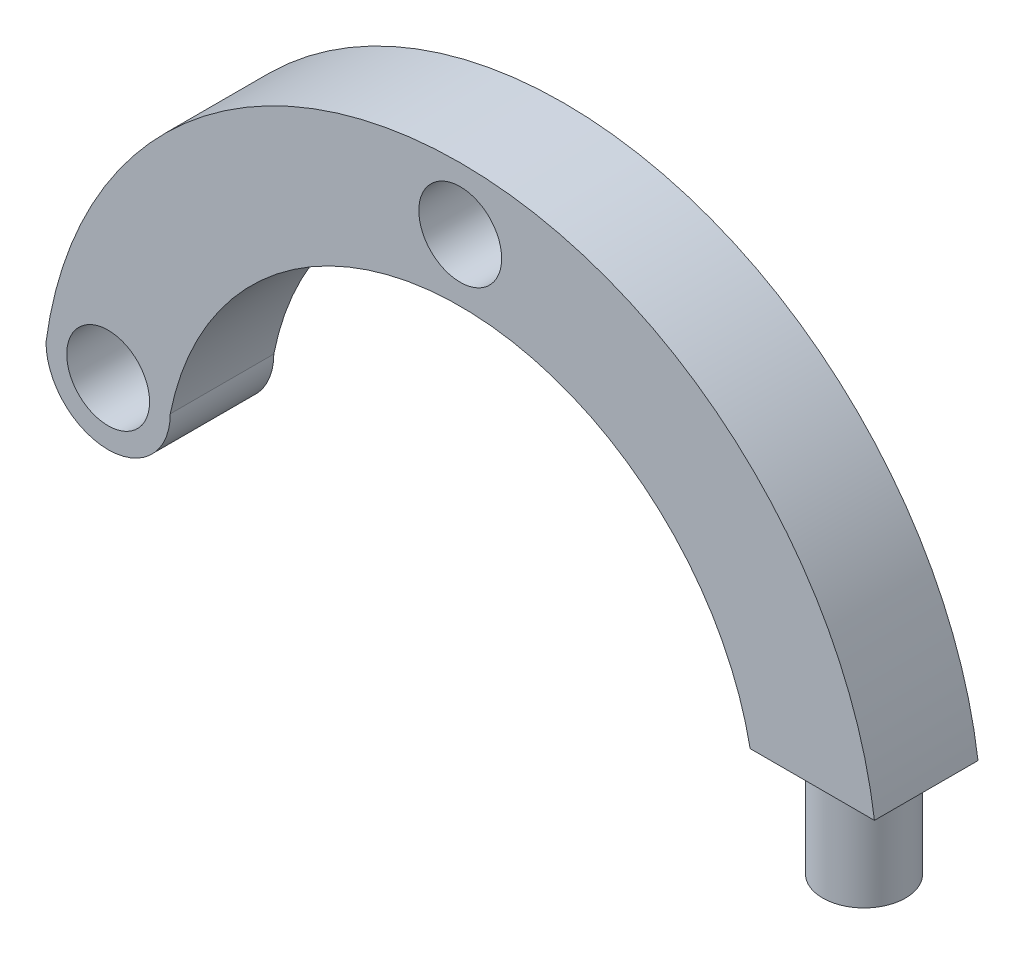
ISO-10303-21;
HEADER;
FILE_DESCRIPTION(('STEP AP214'),'2;1');
FILE_NAME('part.step','',(''),(''),'','','');
FILE_SCHEMA(('AUTOMOTIVE_DESIGN { 1 0 10303 214 1 1 1 1 }'));
ENDSEC;
DATA;
#1=APPLICATION_CONTEXT('core data for automotive mechanical design processes');
#2=APPLICATION_PROTOCOL_DEFINITION('international standard','automotive_design',2000,#1);
#3=PRODUCT_CONTEXT('',#1,'mechanical');
#4=PRODUCT('Part','Part','',(#3));
#5=PRODUCT_RELATED_PRODUCT_CATEGORY('part','',(#4));
#6=PRODUCT_DEFINITION_FORMATION('','',#4);
#7=PRODUCT_DEFINITION_CONTEXT('part definition',#1,'design');
#8=PRODUCT_DEFINITION('design','',#6,#7);
#9=PRODUCT_DEFINITION_SHAPE('','',#8);
#10=(LENGTH_UNIT() NAMED_UNIT(*) SI_UNIT(.MILLI.,.METRE.));
#11=(NAMED_UNIT(*) PLANE_ANGLE_UNIT() SI_UNIT($,.RADIAN.));
#12=(NAMED_UNIT(*) SI_UNIT($,.STERADIAN.) SOLID_ANGLE_UNIT());
#13=UNCERTAINTY_MEASURE_WITH_UNIT(LENGTH_MEASURE(1.E-05),#10,'distance_accuracy_value','');
#14=(GEOMETRIC_REPRESENTATION_CONTEXT(3) GLOBAL_UNCERTAINTY_ASSIGNED_CONTEXT((#13)) GLOBAL_UNIT_ASSIGNED_CONTEXT((#10,
#11,#12)) REPRESENTATION_CONTEXT('',''));
#15=CARTESIAN_POINT('',(0.,0.,0.));
#16=DIRECTION('',(0.,0.,1.));
#17=DIRECTION('',(1.,0.,0.));
#18=AXIS2_PLACEMENT_3D('',#15,#16,#17);
#19=CARTESIAN_POINT('',(-170.,-145.,50.));
#20=DIRECTION('',(0.,0.,1.));
#21=DIRECTION('',(1.,0.,0.));
#22=AXIS2_PLACEMENT_3D('',#19,#20,#21);
#23=PLANE('',#22);
#24=CARTESIAN_POINT('',(0.,0.,50.));
#25=DIRECTION('',(0.,0.,1.));
#26=DIRECTION('',(1.,0.,0.));
#27=AXIS2_PLACEMENT_3D('',#24,#25,#26);
#28=CIRCLE('',#27,20.);
#29=CARTESIAN_POINT('',(20.,0.,50.));
#30=VERTEX_POINT('',#29);
#31=EDGE_CURVE('E109',#30,#30,#28,.T.);
#32=ORIENTED_EDGE('',*,*,#31,.F.);
#33=EDGE_LOOP('',(#32));
#34=FACE_BOUND('',#33,.T.);
#35=CARTESIAN_POINT('',(-170.,-145.,50.));
#36=DIRECTION('',(0.,0.,1.));
#37=DIRECTION('',(1.,0.,0.));
#38=AXIS2_PLACEMENT_3D('',#35,#36,#37);
#39=CIRCLE('',#38,30.);
#40=CARTESIAN_POINT('',(-200.,-145.,50.));
#41=VERTEX_POINT('',#40);
#42=CARTESIAN_POINT('',(-140.,-145.,50.));
#43=VERTEX_POINT('',#42);
#44=EDGE_CURVE('E92',#41,#43,#39,.T.);
#45=ORIENTED_EDGE('',*,*,#44,.T.);
#46=CARTESIAN_POINT('',(0.,-172.717391304348,50.));
#47=DIRECTION('',(0.,0.,-1.));
#48=DIRECTION('',(1.,0.,0.));
#49=AXIS2_PLACEMENT_3D('',#46,#47,#48);
#50=CIRCLE('',#49,142.717391304348);
#51=CARTESIAN_POINT('',(140.,-145.,50.));
#52=VERTEX_POINT('',#51);
#53=EDGE_CURVE('E87',#43,#52,#50,.T.);
#54=ORIENTED_EDGE('',*,*,#53,.T.);
#55=DIRECTION('',(1.,0.,0.));
#56=VECTOR('',#55,1.);
#57=CARTESIAN_POINT('',(140.,-145.,50.));
#58=LINE('',#57,#56);
#59=CARTESIAN_POINT('',(200.,-145.,50.));
#60=VERTEX_POINT('',#59);
#61=EDGE_CURVE('E90',#52,#60,#58,.T.);
#62=ORIENTED_EDGE('',*,*,#61,.T.);
#63=CARTESIAN_POINT('',(0.,-171.785714285714,50.));
#64=DIRECTION('',(0.,0.,1.));
#65=DIRECTION('',(1.,0.,0.));
#66=AXIS2_PLACEMENT_3D('',#63,#64,#65);
#67=CIRCLE('',#66,201.785714285714);
#68=EDGE_CURVE('E56',#60,#41,#67,.T.);
#69=ORIENTED_EDGE('',*,*,#68,.T.);
#70=EDGE_LOOP('',(#45,#54,#62,#69));
#71=FACE_BOUND('',#70,.T.);
#72=CARTESIAN_POINT('',(-170.,-145.,50.));
#73=DIRECTION('',(0.,0.,1.));
#74=DIRECTION('',(1.,0.,0.));
#75=AXIS2_PLACEMENT_3D('',#72,#73,#74);
#76=CIRCLE('',#75,20.);
#77=CARTESIAN_POINT('',(-150.,-145.,50.));
#78=VERTEX_POINT('',#77);
#79=EDGE_CURVE('E129',#78,#78,#76,.T.);
#80=ORIENTED_EDGE('',*,*,#79,.F.);
#81=EDGE_LOOP('',(#80));
#82=FACE_BOUND('',#81,.T.);
#83=ADVANCED_FACE('F39',(#34,#71,#82),#23,.T.);
#84=CARTESIAN_POINT('',(-170.,-145.,0.));
#85=DIRECTION('',(0.,0.,1.));
#86=DIRECTION('',(1.,0.,0.));
#87=AXIS2_PLACEMENT_3D('',#84,#85,#86);
#88=PLANE('',#87);
#89=CARTESIAN_POINT('',(-170.,-145.,0.));
#90=DIRECTION('',(0.,0.,1.));
#91=DIRECTION('',(1.,0.,0.));
#92=AXIS2_PLACEMENT_3D('',#89,#90,#91);
#93=CIRCLE('',#92,30.);
#94=CARTESIAN_POINT('',(-200.,-145.,0.));
#95=VERTEX_POINT('',#94);
#96=CARTESIAN_POINT('',(-140.,-145.,0.));
#97=VERTEX_POINT('',#96);
#98=EDGE_CURVE('E106',#95,#97,#93,.T.);
#99=ORIENTED_EDGE('',*,*,#98,.F.);
#100=CARTESIAN_POINT('',(0.,-171.785714285714,0.));
#101=DIRECTION('',(0.,0.,1.));
#102=DIRECTION('',(1.,0.,0.));
#103=AXIS2_PLACEMENT_3D('',#100,#101,#102);
#104=CIRCLE('',#103,201.785714285714);
#105=CARTESIAN_POINT('',(200.,-145.,0.));
#106=VERTEX_POINT('',#105);
#107=EDGE_CURVE('E79',#106,#95,#104,.T.);
#108=ORIENTED_EDGE('',*,*,#107,.F.);
#109=DIRECTION('',(1.,0.,0.));
#110=VECTOR('',#109,1.);
#111=CARTESIAN_POINT('',(140.,-145.,0.));
#112=LINE('',#111,#110);
#113=CARTESIAN_POINT('',(140.,-145.,0.));
#114=VERTEX_POINT('',#113);
#115=EDGE_CURVE('E73',#114,#106,#112,.T.);
#116=ORIENTED_EDGE('',*,*,#115,.F.);
#117=CARTESIAN_POINT('',(0.,-172.717391304348,0.));
#118=DIRECTION('',(0.,0.,-1.));
#119=DIRECTION('',(1.,0.,0.));
#120=AXIS2_PLACEMENT_3D('',#117,#118,#119);
#121=CIRCLE('',#120,142.717391304348);
#122=EDGE_CURVE('E97',#97,#114,#121,.T.);
#123=ORIENTED_EDGE('',*,*,#122,.F.);
#124=EDGE_LOOP('',(#99,#108,#116,#123));
#125=FACE_BOUND('',#124,.T.);
#126=CARTESIAN_POINT('',(0.,0.,0.));
#127=DIRECTION('',(0.,0.,1.));
#128=DIRECTION('',(1.,0.,0.));
#129=AXIS2_PLACEMENT_3D('',#126,#127,#128);
#130=CIRCLE('',#129,20.);
#131=CARTESIAN_POINT('',(20.,0.,0.));
#132=VERTEX_POINT('',#131);
#133=EDGE_CURVE('E124',#132,#132,#130,.T.);
#134=ORIENTED_EDGE('',*,*,#133,.T.);
#135=EDGE_LOOP('',(#134));
#136=FACE_BOUND('',#135,.T.);
#137=CARTESIAN_POINT('',(-170.,-145.,0.));
#138=DIRECTION('',(0.,0.,1.));
#139=DIRECTION('',(1.,0.,0.));
#140=AXIS2_PLACEMENT_3D('',#137,#138,#139);
#141=CIRCLE('',#140,20.);
#142=CARTESIAN_POINT('',(-150.,-145.,0.));
#143=VERTEX_POINT('',#142);
#144=EDGE_CURVE('E127',#143,#143,#141,.T.);
#145=ORIENTED_EDGE('',*,*,#144,.T.);
#146=EDGE_LOOP('',(#145));
#147=FACE_BOUND('',#146,.T.);
#148=ADVANCED_FACE('F117',(#125,#136,#147),#88,.F.);
#149=CARTESIAN_POINT('',(-170.,-145.,50.));
#150=DIRECTION('',(0.,0.,-1.));
#151=DIRECTION('',(-1.,0.,0.));
#152=AXIS2_PLACEMENT_3D('',#149,#150,#151);
#153=CYLINDRICAL_SURFACE('',#152,30.);
#154=ORIENTED_EDGE('',*,*,#98,.T.);
#155=DIRECTION('',(0.,0.,-1.));
#156=VECTOR('',#155,1.);
#157=CARTESIAN_POINT('',(-140.,-145.,50.));
#158=LINE('',#157,#156);
#159=EDGE_CURVE('E48',#43,#97,#158,.T.);
#160=ORIENTED_EDGE('',*,*,#159,.F.);
#161=ORIENTED_EDGE('',*,*,#44,.F.);
#162=DIRECTION('',(0.,0.,-1.));
#163=VECTOR('',#162,1.);
#164=CARTESIAN_POINT('',(-200.,-145.,50.));
#165=LINE('',#164,#163);
#166=EDGE_CURVE('E102',#41,#95,#165,.T.);
#167=ORIENTED_EDGE('',*,*,#166,.T.);
#168=EDGE_LOOP('',(#154,#160,#161,#167));
#169=FACE_BOUND('',#168,.T.);
#170=ADVANCED_FACE('F41',(#169),#153,.T.);
#171=CARTESIAN_POINT('',(0.,-172.717391304348,50.));
#172=DIRECTION('',(0.,0.,-1.));
#173=DIRECTION('',(-1.,0.,0.));
#174=AXIS2_PLACEMENT_3D('',#171,#172,#173);
#175=CYLINDRICAL_SURFACE('',#174,142.717391304348);
#176=ORIENTED_EDGE('',*,*,#122,.T.);
#177=DIRECTION('',(0.,0.,-1.));
#178=VECTOR('',#177,1.);
#179=CARTESIAN_POINT('',(140.,-145.,50.));
#180=LINE('',#179,#178);
#181=EDGE_CURVE('E95',#52,#114,#180,.T.);
#182=ORIENTED_EDGE('',*,*,#181,.F.);
#183=ORIENTED_EDGE('',*,*,#53,.F.);
#184=ORIENTED_EDGE('',*,*,#159,.T.);
#185=EDGE_LOOP('',(#176,#182,#183,#184));
#186=FACE_BOUND('',#185,.T.);
#187=ADVANCED_FACE('F96',(#186),#175,.F.);
#188=CARTESIAN_POINT('',(140.,-145.,50.));
#189=DIRECTION('',(0.,1.,0.));
#190=DIRECTION('',(-1.,0.,0.));
#191=AXIS2_PLACEMENT_3D('',#188,#189,#190);
#192=PLANE('',#191);
#193=CARTESIAN_POINT('',(170.,-145.,25.));
#194=DIRECTION('',(0.,1.,0.));
#195=DIRECTION('',(-1.,0.,0.));
#196=AXIS2_PLACEMENT_3D('',#193,#194,#195);
#197=CIRCLE('',#196,20.);
#198=CARTESIAN_POINT('',(150.,-145.,25.));
#199=VERTEX_POINT('',#198);
#200=EDGE_CURVE('E11',#199,#199,#197,.F.);
#201=ORIENTED_EDGE('',*,*,#200,.F.);
#202=EDGE_LOOP('',(#201));
#203=FACE_BOUND('',#202,.T.);
#204=ORIENTED_EDGE('',*,*,#115,.T.);
#205=DIRECTION('',(0.,0.,-1.));
#206=VECTOR('',#205,1.);
#207=CARTESIAN_POINT('',(200.,-145.,50.));
#208=LINE('',#207,#206);
#209=EDGE_CURVE('E98',#60,#106,#208,.T.);
#210=ORIENTED_EDGE('',*,*,#209,.F.);
#211=ORIENTED_EDGE('',*,*,#61,.F.);
#212=ORIENTED_EDGE('',*,*,#181,.T.);
#213=EDGE_LOOP('',(#204,#210,#211,#212));
#214=FACE_BOUND('',#213,.T.);
#215=ADVANCED_FACE('F100',(#203,#214),#192,.F.);
#216=CARTESIAN_POINT('',(0.,-171.785714285714,50.));
#217=DIRECTION('',(0.,0.,-1.));
#218=DIRECTION('',(-1.,0.,0.));
#219=AXIS2_PLACEMENT_3D('',#216,#217,#218);
#220=CYLINDRICAL_SURFACE('',#219,201.785714285714);
#221=ORIENTED_EDGE('',*,*,#107,.T.);
#222=ORIENTED_EDGE('',*,*,#166,.F.);
#223=ORIENTED_EDGE('',*,*,#68,.F.);
#224=ORIENTED_EDGE('',*,*,#209,.T.);
#225=EDGE_LOOP('',(#221,#222,#223,#224));
#226=FACE_BOUND('',#225,.T.);
#227=ADVANCED_FACE('F151',(#226),#220,.T.);
#228=CARTESIAN_POINT('',(0.,0.,50.));
#229=DIRECTION('',(0.,0.,-1.));
#230=DIRECTION('',(-1.,0.,0.));
#231=AXIS2_PLACEMENT_3D('',#228,#229,#230);
#232=CYLINDRICAL_SURFACE('',#231,20.);
#233=ORIENTED_EDGE('',*,*,#31,.T.);
#234=EDGE_LOOP('',(#233));
#235=FACE_BOUND('',#234,.T.);
#236=ORIENTED_EDGE('',*,*,#133,.F.);
#237=EDGE_LOOP('',(#236));
#238=FACE_BOUND('',#237,.T.);
#239=ADVANCED_FACE('F141',(#235,#238),#232,.F.);
#240=CARTESIAN_POINT('',(-170.,-145.,50.));
#241=DIRECTION('',(0.,0.,-1.));
#242=DIRECTION('',(-1.,0.,0.));
#243=AXIS2_PLACEMENT_3D('',#240,#241,#242);
#244=CYLINDRICAL_SURFACE('',#243,20.);
#245=ORIENTED_EDGE('',*,*,#79,.T.);
#246=EDGE_LOOP('',(#245));
#247=FACE_BOUND('',#246,.T.);
#248=ORIENTED_EDGE('',*,*,#144,.F.);
#249=EDGE_LOOP('',(#248));
#250=FACE_BOUND('',#249,.T.);
#251=ADVANCED_FACE('F195',(#247,#250),#244,.F.);
#252=CARTESIAN_POINT('',(170.,-195.,25.));
#253=DIRECTION('',(0.,1.,0.));
#254=DIRECTION('',(-1.,0.,0.));
#255=AXIS2_PLACEMENT_3D('',#252,#253,#254);
#256=CYLINDRICAL_SURFACE('',#255,20.);
#257=CARTESIAN_POINT('',(170.,-195.,25.));
#258=DIRECTION('',(0.,-1.,0.));
#259=DIRECTION('',(1.,0.,0.));
#260=AXIS2_PLACEMENT_3D('',#257,#258,#259);
#261=CIRCLE('',#260,20.);
#262=CARTESIAN_POINT('',(190.,-195.,25.));
#263=VERTEX_POINT('',#262);
#264=EDGE_CURVE('E130',#263,#263,#261,.T.);
#265=ORIENTED_EDGE('',*,*,#264,.F.);
#266=EDGE_LOOP('',(#265));
#267=FACE_BOUND('',#266,.T.);
#268=ORIENTED_EDGE('',*,*,#200,.T.);
#269=EDGE_LOOP('',(#268));
#270=FACE_BOUND('',#269,.T.);
#271=ADVANCED_FACE('F202',(#267,#270),#256,.T.);
#272=CARTESIAN_POINT('',(170.,-195.,25.));
#273=DIRECTION('',(0.,-1.,0.));
#274=DIRECTION('',(1.,0.,0.));
#275=AXIS2_PLACEMENT_3D('',#272,#273,#274);
#276=PLANE('',#275);
#277=ORIENTED_EDGE('',*,*,#264,.T.);
#278=EDGE_LOOP('',(#277));
#279=FACE_BOUND('',#278,.T.);
#280=ADVANCED_FACE('F210',(#279),#276,.T.);
#281=CLOSED_SHELL('',(#83,#148,#170,#187,#215,#227,#239,#251,#271,#280));
#282=MANIFOLD_SOLID_BREP('B2',#281);
#283=ADVANCED_BREP_SHAPE_REPRESENTATION('',(#18,#282),#14);
#284=SHAPE_DEFINITION_REPRESENTATION(#9,#283);
ENDSEC;
END-ISO-10303-21;
